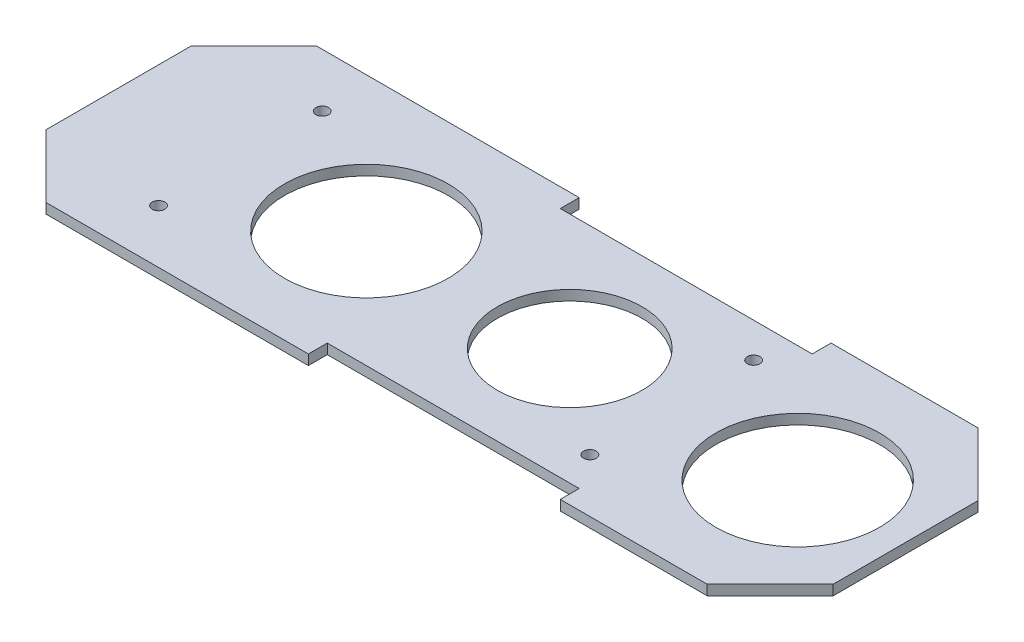
ISO-10303-21;
HEADER;
FILE_DESCRIPTION(('STEP AP214'),'2;1');
FILE_NAME('part.step','',(''),(''),'','','');
FILE_SCHEMA(('AUTOMOTIVE_DESIGN { 1 0 10303 214 1 1 1 1 }'));
ENDSEC;
DATA;
#1=APPLICATION_CONTEXT('core data for automotive mechanical design processes');
#2=APPLICATION_PROTOCOL_DEFINITION('international standard','automotive_design',2000,#1);
#3=PRODUCT_CONTEXT('',#1,'mechanical');
#4=PRODUCT('Part','Part','',(#3));
#5=PRODUCT_RELATED_PRODUCT_CATEGORY('part','',(#4));
#6=PRODUCT_DEFINITION_FORMATION('','',#4);
#7=PRODUCT_DEFINITION_CONTEXT('part definition',#1,'design');
#8=PRODUCT_DEFINITION('design','',#6,#7);
#9=PRODUCT_DEFINITION_SHAPE('','',#8);
#10=(LENGTH_UNIT() NAMED_UNIT(*) SI_UNIT(.MILLI.,.METRE.));
#11=(NAMED_UNIT(*) PLANE_ANGLE_UNIT() SI_UNIT($,.RADIAN.));
#12=(NAMED_UNIT(*) SI_UNIT($,.STERADIAN.) SOLID_ANGLE_UNIT());
#13=UNCERTAINTY_MEASURE_WITH_UNIT(LENGTH_MEASURE(1.E-05),#10,'distance_accuracy_value','');
#14=(GEOMETRIC_REPRESENTATION_CONTEXT(3) GLOBAL_UNCERTAINTY_ASSIGNED_CONTEXT((#13)) GLOBAL_UNIT_ASSIGNED_CONTEXT((#10,
#11,#12)) REPRESENTATION_CONTEXT('',''));
#15=CARTESIAN_POINT('',(0.,0.,0.));
#16=DIRECTION('',(0.,0.,1.));
#17=DIRECTION('',(1.,0.,0.));
#18=AXIS2_PLACEMENT_3D('',#15,#16,#17);
#19=CARTESIAN_POINT('',(91.6666666666666,1.6,0.));
#20=DIRECTION('',(-1.,0.,0.));
#21=DIRECTION('',(0.,0.,1.));
#22=AXIS2_PLACEMENT_3D('',#19,#20,#21);
#23=PLANE('',#22);
#24=DIRECTION('',(0.,0.,-1.));
#25=VECTOR('',#24,1.);
#26=CARTESIAN_POINT('',(91.6666666666666,0.,0.));
#27=LINE('',#26,#25);
#28=CARTESIAN_POINT('',(91.6666666666666,0.,21.5));
#29=VERTEX_POINT('',#28);
#30=CARTESIAN_POINT('',(91.6666666666666,0.,18.5));
#31=VERTEX_POINT('',#30);
#32=EDGE_CURVE('E159',#29,#31,#27,.T.);
#33=ORIENTED_EDGE('',*,*,#32,.F.);
#34=DIRECTION('',(0.,-1.,0.));
#35=VECTOR('',#34,1.);
#36=CARTESIAN_POINT('',(91.6666666666666,1.6,21.5));
#37=LINE('',#36,#35);
#38=CARTESIAN_POINT('',(91.6666666666666,1.6,21.5));
#39=VERTEX_POINT('',#38);
#40=EDGE_CURVE('E154',#39,#29,#37,.T.);
#41=ORIENTED_EDGE('',*,*,#40,.F.);
#42=DIRECTION('',(0.,0.,-1.));
#43=VECTOR('',#42,1.);
#44=CARTESIAN_POINT('',(91.6666666666666,1.6,0.));
#45=LINE('',#44,#43);
#46=CARTESIAN_POINT('',(91.6666666666666,1.6,18.5));
#47=VERTEX_POINT('',#46);
#48=EDGE_CURVE('E157',#39,#47,#45,.T.);
#49=ORIENTED_EDGE('',*,*,#48,.T.);
#50=DIRECTION('',(0.,-1.,0.));
#51=VECTOR('',#50,1.);
#52=CARTESIAN_POINT('',(91.6666666666666,1.6,18.5));
#53=LINE('',#52,#51);
#54=EDGE_CURVE('E212',#47,#31,#53,.T.);
#55=ORIENTED_EDGE('',*,*,#54,.T.);
#56=EDGE_LOOP('',(#33,#41,#49,#55));
#57=FACE_BOUND('',#56,.T.);
#58=ADVANCED_FACE('F40',(#57),#23,.T.);
#59=CARTESIAN_POINT('',(0.,1.6,21.5000000000002));
#60=DIRECTION('',(0.,0.,-1.));
#61=DIRECTION('',(-1.,0.,0.));
#62=AXIS2_PLACEMENT_3D('',#59,#60,#61);
#63=PLANE('',#62);
#64=DIRECTION('',(1.,0.,0.));
#65=VECTOR('',#64,1.);
#66=CARTESIAN_POINT('',(0.,0.,21.5000000000002));
#67=LINE('',#66,#65);
#68=CARTESIAN_POINT('',(115.,0.,21.4999999999999));
#69=VERTEX_POINT('',#68);
#70=EDGE_CURVE('E232',#29,#69,#67,.T.);
#71=ORIENTED_EDGE('',*,*,#70,.T.);
#72=DIRECTION('',(0.,1.,0.));
#73=VECTOR('',#72,1.);
#74=CARTESIAN_POINT('',(115.,1.6,21.4999999999999));
#75=LINE('',#74,#73);
#76=CARTESIAN_POINT('',(115.,1.6,21.4999999999999));
#77=VERTEX_POINT('',#76);
#78=EDGE_CURVE('E170',#69,#77,#75,.T.);
#79=ORIENTED_EDGE('',*,*,#78,.T.);
#80=DIRECTION('',(1.,0.,0.));
#81=VECTOR('',#80,1.);
#82=CARTESIAN_POINT('',(0.,1.6,21.5000000000002));
#83=LINE('',#82,#81);
#84=EDGE_CURVE('E167',#39,#77,#83,.T.);
#85=ORIENTED_EDGE('',*,*,#84,.F.);
#86=ORIENTED_EDGE('',*,*,#40,.T.);
#87=EDGE_LOOP('',(#71,#79,#85,#86));
#88=FACE_BOUND('',#87,.T.);
#89=ADVANCED_FACE('F168',(#88),#63,.F.);
#90=CARTESIAN_POINT('',(125.,1.6,0.));
#91=DIRECTION('',(1.,0.,0.));
#92=DIRECTION('',(0.,0.,-1.));
#93=AXIS2_PLACEMENT_3D('',#90,#91,#92);
#94=PLANE('',#93);
#95=DIRECTION('',(0.,0.,1.));
#96=VECTOR('',#95,1.);
#97=CARTESIAN_POINT('',(125.,0.,0.));
#98=LINE('',#97,#96);
#99=CARTESIAN_POINT('',(125.,0.,-11.4999999999999));
#100=VERTEX_POINT('',#99);
#101=CARTESIAN_POINT('',(125.,0.,11.4999999999999));
#102=VERTEX_POINT('',#101);
#103=EDGE_CURVE('E234',#100,#102,#98,.T.);
#104=ORIENTED_EDGE('',*,*,#103,.F.);
#105=DIRECTION('',(0.,1.,0.));
#106=VECTOR('',#105,1.);
#107=CARTESIAN_POINT('',(125.,1.6,-11.4999999999999));
#108=LINE('',#107,#106);
#109=CARTESIAN_POINT('',(125.,1.6,-11.4999999999999));
#110=VERTEX_POINT('',#109);
#111=EDGE_CURVE('E293',#100,#110,#108,.T.);
#112=ORIENTED_EDGE('',*,*,#111,.T.);
#113=DIRECTION('',(0.,0.,1.));
#114=VECTOR('',#113,1.);
#115=CARTESIAN_POINT('',(125.,1.6,0.));
#116=LINE('',#115,#114);
#117=CARTESIAN_POINT('',(125.,1.6,11.4999999999999));
#118=VERTEX_POINT('',#117);
#119=EDGE_CURVE('E172',#110,#118,#116,.T.);
#120=ORIENTED_EDGE('',*,*,#119,.T.);
#121=DIRECTION('',(0.,-1.,0.));
#122=VECTOR('',#121,1.);
#123=CARTESIAN_POINT('',(125.,0.,11.4999999999999));
#124=LINE('',#123,#122);
#125=EDGE_CURVE('E290',#118,#102,#124,.T.);
#126=ORIENTED_EDGE('',*,*,#125,.T.);
#127=EDGE_LOOP('',(#104,#112,#120,#126));
#128=FACE_BOUND('',#127,.T.);
#129=ADVANCED_FACE('F337',(#128),#94,.T.);
#130=CARTESIAN_POINT('',(0.,1.6,-21.5));
#131=DIRECTION('',(0.,0.,-1.));
#132=DIRECTION('',(-1.,0.,0.));
#133=AXIS2_PLACEMENT_3D('',#130,#131,#132);
#134=PLANE('',#133);
#135=DIRECTION('',(1.,0.,0.));
#136=VECTOR('',#135,1.);
#137=CARTESIAN_POINT('',(0.,1.6,-21.5));
#138=LINE('',#137,#136);
#139=CARTESIAN_POINT('',(91.6666666666666,1.6,-21.5));
#140=VERTEX_POINT('',#139);
#141=CARTESIAN_POINT('',(115.,1.6,-21.5));
#142=VERTEX_POINT('',#141);
#143=EDGE_CURVE('E189',#140,#142,#138,.T.);
#144=ORIENTED_EDGE('',*,*,#143,.T.);
#145=DIRECTION('',(0.,-1.,0.));
#146=VECTOR('',#145,1.);
#147=CARTESIAN_POINT('',(115.,1.6,-21.5));
#148=LINE('',#147,#146);
#149=CARTESIAN_POINT('',(115.,0.,-21.5));
#150=VERTEX_POINT('',#149);
#151=EDGE_CURVE('E163',#142,#150,#148,.T.);
#152=ORIENTED_EDGE('',*,*,#151,.T.);
#153=DIRECTION('',(1.,0.,0.));
#154=VECTOR('',#153,1.);
#155=CARTESIAN_POINT('',(0.,0.,-21.5));
#156=LINE('',#155,#154);
#157=CARTESIAN_POINT('',(91.6666666666666,0.,-21.5));
#158=VERTEX_POINT('',#157);
#159=EDGE_CURVE('E237',#158,#150,#156,.T.);
#160=ORIENTED_EDGE('',*,*,#159,.F.);
#161=DIRECTION('',(0.,-1.,0.));
#162=VECTOR('',#161,1.);
#163=CARTESIAN_POINT('',(91.6666666666666,1.6,-21.5));
#164=LINE('',#163,#162);
#165=EDGE_CURVE('E164',#140,#158,#164,.T.);
#166=ORIENTED_EDGE('',*,*,#165,.F.);
#167=EDGE_LOOP('',(#144,#152,#160,#166));
#168=FACE_BOUND('',#167,.T.);
#169=ADVANCED_FACE('F344',(#168),#134,.T.);
#170=CARTESIAN_POINT('',(91.6666666666666,1.6,0.));
#171=DIRECTION('',(1.,0.,0.));
#172=DIRECTION('',(0.,0.,-1.));
#173=AXIS2_PLACEMENT_3D('',#170,#171,#172);
#174=PLANE('',#173);
#175=DIRECTION('',(0.,0.,1.));
#176=VECTOR('',#175,1.);
#177=CARTESIAN_POINT('',(91.6666666666666,0.,0.));
#178=LINE('',#177,#176);
#179=CARTESIAN_POINT('',(91.6666666666666,0.,-18.5));
#180=VERTEX_POINT('',#179);
#181=EDGE_CURVE('E240',#158,#180,#178,.T.);
#182=ORIENTED_EDGE('',*,*,#181,.T.);
#183=DIRECTION('',(0.,-1.,0.));
#184=VECTOR('',#183,1.);
#185=CARTESIAN_POINT('',(91.6666666666666,1.6,-18.5));
#186=LINE('',#185,#184);
#187=CARTESIAN_POINT('',(91.6666666666666,1.6,-18.5));
#188=VERTEX_POINT('',#187);
#189=EDGE_CURVE('E277',#188,#180,#186,.T.);
#190=ORIENTED_EDGE('',*,*,#189,.F.);
#191=DIRECTION('',(0.,0.,1.));
#192=VECTOR('',#191,1.);
#193=CARTESIAN_POINT('',(91.6666666666666,1.6,0.));
#194=LINE('',#193,#192);
#195=EDGE_CURVE('E192',#140,#188,#194,.T.);
#196=ORIENTED_EDGE('',*,*,#195,.F.);
#197=ORIENTED_EDGE('',*,*,#165,.T.);
#198=EDGE_LOOP('',(#182,#190,#196,#197));
#199=FACE_BOUND('',#198,.T.);
#200=ADVANCED_FACE('F350',(#199),#174,.F.);
#201=CARTESIAN_POINT('',(0.,1.6,-18.5));
#202=DIRECTION('',(0.,0.,-1.));
#203=DIRECTION('',(-1.,0.,0.));
#204=AXIS2_PLACEMENT_3D('',#201,#202,#203);
#205=PLANE('',#204);
#206=DIRECTION('',(1.,0.,0.));
#207=VECTOR('',#206,1.);
#208=CARTESIAN_POINT('',(0.,0.,-18.5));
#209=LINE('',#208,#207);
#210=CARTESIAN_POINT('',(51.6666666666666,0.,-18.5));
#211=VERTEX_POINT('',#210);
#212=EDGE_CURVE('E243',#211,#180,#209,.T.);
#213=ORIENTED_EDGE('',*,*,#212,.F.);
#214=DIRECTION('',(0.,-1.,0.));
#215=VECTOR('',#214,1.);
#216=CARTESIAN_POINT('',(51.6666666666666,1.6,-18.5));
#217=LINE('',#216,#215);
#218=CARTESIAN_POINT('',(51.6666666666666,1.6,-18.5));
#219=VERTEX_POINT('',#218);
#220=EDGE_CURVE('E275',#219,#211,#217,.T.);
#221=ORIENTED_EDGE('',*,*,#220,.F.);
#222=DIRECTION('',(1.,0.,0.));
#223=VECTOR('',#222,1.);
#224=CARTESIAN_POINT('',(0.,1.6,-18.5));
#225=LINE('',#224,#223);
#226=EDGE_CURVE('E194',#219,#188,#225,.T.);
#227=ORIENTED_EDGE('',*,*,#226,.T.);
#228=ORIENTED_EDGE('',*,*,#189,.T.);
#229=EDGE_LOOP('',(#213,#221,#227,#228));
#230=FACE_BOUND('',#229,.T.);
#231=ADVANCED_FACE('F572',(#230),#205,.T.);
#232=CARTESIAN_POINT('',(51.6666666666666,1.6,0.));
#233=DIRECTION('',(1.,0.,0.));
#234=DIRECTION('',(0.,0.,-1.));
#235=AXIS2_PLACEMENT_3D('',#232,#233,#234);
#236=PLANE('',#235);
#237=DIRECTION('',(0.,0.,1.));
#238=VECTOR('',#237,1.);
#239=CARTESIAN_POINT('',(51.6666666666666,0.,0.));
#240=LINE('',#239,#238);
#241=CARTESIAN_POINT('',(51.6666666666666,0.,-21.5));
#242=VERTEX_POINT('',#241);
#243=EDGE_CURVE('E246',#242,#211,#240,.T.);
#244=ORIENTED_EDGE('',*,*,#243,.F.);
#245=DIRECTION('',(0.,-1.,0.));
#246=VECTOR('',#245,1.);
#247=CARTESIAN_POINT('',(51.6666666666666,1.6,-21.5));
#248=LINE('',#247,#246);
#249=CARTESIAN_POINT('',(51.6666666666666,1.6,-21.5));
#250=VERTEX_POINT('',#249);
#251=EDGE_CURVE('E272',#250,#242,#248,.T.);
#252=ORIENTED_EDGE('',*,*,#251,.F.);
#253=DIRECTION('',(0.,0.,1.));
#254=VECTOR('',#253,1.);
#255=CARTESIAN_POINT('',(51.6666666666666,1.6,0.));
#256=LINE('',#255,#254);
#257=EDGE_CURVE('E197',#250,#219,#256,.T.);
#258=ORIENTED_EDGE('',*,*,#257,.T.);
#259=ORIENTED_EDGE('',*,*,#220,.T.);
#260=EDGE_LOOP('',(#244,#252,#258,#259));
#261=FACE_BOUND('',#260,.T.);
#262=ADVANCED_FACE('F358',(#261),#236,.T.);
#263=CARTESIAN_POINT('',(0.,1.6,-21.5));
#264=DIRECTION('',(0.,0.,-1.));
#265=DIRECTION('',(-1.,0.,0.));
#266=AXIS2_PLACEMENT_3D('',#263,#264,#265);
#267=PLANE('',#266);
#268=DIRECTION('',(1.,0.,0.));
#269=VECTOR('',#268,1.);
#270=CARTESIAN_POINT('',(0.,0.,-21.5));
#271=LINE('',#270,#269);
#272=CARTESIAN_POINT('',(10.,0.,-21.5));
#273=VERTEX_POINT('',#272);
#274=EDGE_CURVE('E249',#273,#242,#271,.T.);
#275=ORIENTED_EDGE('',*,*,#274,.F.);
#276=DIRECTION('',(0.,1.,0.));
#277=VECTOR('',#276,1.);
#278=CARTESIAN_POINT('',(10.,1.6,-21.5));
#279=LINE('',#278,#277);
#280=CARTESIAN_POINT('',(10.,1.6,-21.5));
#281=VERTEX_POINT('',#280);
#282=EDGE_CURVE('E11',#273,#281,#279,.T.);
#283=ORIENTED_EDGE('',*,*,#282,.T.);
#284=DIRECTION('',(1.,0.,0.));
#285=VECTOR('',#284,1.);
#286=CARTESIAN_POINT('',(0.,1.6,-21.5));
#287=LINE('',#286,#285);
#288=EDGE_CURVE('E200',#281,#250,#287,.T.);
#289=ORIENTED_EDGE('',*,*,#288,.T.);
#290=ORIENTED_EDGE('',*,*,#251,.T.);
#291=EDGE_LOOP('',(#275,#283,#289,#290));
#292=FACE_BOUND('',#291,.T.);
#293=ADVANCED_FACE('F361',(#292),#267,.T.);
#294=CARTESIAN_POINT('',(0.,1.6,0.));
#295=DIRECTION('',(1.,0.,0.));
#296=DIRECTION('',(0.,0.,-1.));
#297=AXIS2_PLACEMENT_3D('',#294,#295,#296);
#298=PLANE('',#297);
#299=DIRECTION('',(0.,0.,1.));
#300=VECTOR('',#299,1.);
#301=CARTESIAN_POINT('',(0.,0.,0.));
#302=LINE('',#301,#300);
#303=CARTESIAN_POINT('',(0.,0.,-11.5));
#304=VERTEX_POINT('',#303);
#305=CARTESIAN_POINT('',(0.,0.,11.5));
#306=VERTEX_POINT('',#305);
#307=EDGE_CURVE('E251',#304,#306,#302,.T.);
#308=ORIENTED_EDGE('',*,*,#307,.T.);
#309=DIRECTION('',(0.,1.,0.));
#310=VECTOR('',#309,1.);
#311=CARTESIAN_POINT('',(0.,1.6,11.5));
#312=LINE('',#311,#310);
#313=CARTESIAN_POINT('',(0.,1.6,11.5));
#314=VERTEX_POINT('',#313);
#315=EDGE_CURVE('E49',#306,#314,#312,.T.);
#316=ORIENTED_EDGE('',*,*,#315,.T.);
#317=DIRECTION('',(0.,0.,1.));
#318=VECTOR('',#317,1.);
#319=CARTESIAN_POINT('',(0.,1.6,0.));
#320=LINE('',#319,#318);
#321=CARTESIAN_POINT('',(0.,1.6,-11.5));
#322=VERTEX_POINT('',#321);
#323=EDGE_CURVE('E202',#322,#314,#320,.T.);
#324=ORIENTED_EDGE('',*,*,#323,.F.);
#325=DIRECTION('',(0.,-1.,0.));
#326=VECTOR('',#325,1.);
#327=CARTESIAN_POINT('',(0.,0.,-11.5));
#328=LINE('',#327,#326);
#329=EDGE_CURVE('E306',#322,#304,#328,.T.);
#330=ORIENTED_EDGE('',*,*,#329,.T.);
#331=EDGE_LOOP('',(#308,#316,#324,#330));
#332=FACE_BOUND('',#331,.T.);
#333=ADVANCED_FACE('F310',(#332),#298,.F.);
#334=CARTESIAN_POINT('',(0.,1.6,21.5));
#335=DIRECTION('',(0.,0.,-1.));
#336=DIRECTION('',(-1.,0.,0.));
#337=AXIS2_PLACEMENT_3D('',#334,#335,#336);
#338=PLANE('',#337);
#339=DIRECTION('',(1.,0.,0.));
#340=VECTOR('',#339,1.);
#341=CARTESIAN_POINT('',(0.,1.6,21.5));
#342=LINE('',#341,#340);
#343=CARTESIAN_POINT('',(10.,1.6,21.5));
#344=VERTEX_POINT('',#343);
#345=CARTESIAN_POINT('',(51.6666666666666,1.6,21.5));
#346=VERTEX_POINT('',#345);
#347=EDGE_CURVE('E204',#344,#346,#342,.T.);
#348=ORIENTED_EDGE('',*,*,#347,.F.);
#349=DIRECTION('',(0.,-1.,0.));
#350=VECTOR('',#349,1.);
#351=CARTESIAN_POINT('',(10.,1.6,21.5));
#352=LINE('',#351,#350);
#353=CARTESIAN_POINT('',(10.,0.,21.5));
#354=VERTEX_POINT('',#353);
#355=EDGE_CURVE('E303',#344,#354,#352,.T.);
#356=ORIENTED_EDGE('',*,*,#355,.T.);
#357=DIRECTION('',(1.,0.,0.));
#358=VECTOR('',#357,1.);
#359=CARTESIAN_POINT('',(0.,0.,21.5));
#360=LINE('',#359,#358);
#361=CARTESIAN_POINT('',(51.6666666666666,0.,21.5));
#362=VERTEX_POINT('',#361);
#363=EDGE_CURVE('E253',#354,#362,#360,.T.);
#364=ORIENTED_EDGE('',*,*,#363,.T.);
#365=DIRECTION('',(0.,-1.,0.));
#366=VECTOR('',#365,1.);
#367=CARTESIAN_POINT('',(51.6666666666666,1.6,21.5));
#368=LINE('',#367,#366);
#369=EDGE_CURVE('E269',#346,#362,#368,.T.);
#370=ORIENTED_EDGE('',*,*,#369,.F.);
#371=EDGE_LOOP('',(#348,#356,#364,#370));
#372=FACE_BOUND('',#371,.T.);
#373=ADVANCED_FACE('F323',(#372),#338,.F.);
#374=CARTESIAN_POINT('',(51.6666666666666,1.6,0.));
#375=DIRECTION('',(-1.,0.,0.));
#376=DIRECTION('',(0.,0.,1.));
#377=AXIS2_PLACEMENT_3D('',#374,#375,#376);
#378=PLANE('',#377);
#379=DIRECTION('',(0.,0.,-1.));
#380=VECTOR('',#379,1.);
#381=CARTESIAN_POINT('',(51.6666666666666,0.,0.));
#382=LINE('',#381,#380);
#383=CARTESIAN_POINT('',(51.6666666666666,0.,18.5));
#384=VERTEX_POINT('',#383);
#385=EDGE_CURVE('E255',#362,#384,#382,.T.);
#386=ORIENTED_EDGE('',*,*,#385,.T.);
#387=DIRECTION('',(0.,-1.,0.));
#388=VECTOR('',#387,1.);
#389=CARTESIAN_POINT('',(51.6666666666666,1.6,18.5));
#390=LINE('',#389,#388);
#391=CARTESIAN_POINT('',(51.6666666666666,1.6,18.5));
#392=VERTEX_POINT('',#391);
#393=EDGE_CURVE('E266',#392,#384,#390,.T.);
#394=ORIENTED_EDGE('',*,*,#393,.F.);
#395=DIRECTION('',(0.,0.,-1.));
#396=VECTOR('',#395,1.);
#397=CARTESIAN_POINT('',(51.6666666666666,1.6,0.));
#398=LINE('',#397,#396);
#399=EDGE_CURVE('E206',#346,#392,#398,.T.);
#400=ORIENTED_EDGE('',*,*,#399,.F.);
#401=ORIENTED_EDGE('',*,*,#369,.T.);
#402=EDGE_LOOP('',(#386,#394,#400,#401));
#403=FACE_BOUND('',#402,.T.);
#404=ADVANCED_FACE('F328',(#403),#378,.F.);
#405=CARTESIAN_POINT('',(0.,1.6,18.5));
#406=DIRECTION('',(0.,0.,-1.));
#407=DIRECTION('',(-1.,0.,0.));
#408=AXIS2_PLACEMENT_3D('',#405,#406,#407);
#409=PLANE('',#408);
#410=DIRECTION('',(1.,0.,0.));
#411=VECTOR('',#410,1.);
#412=CARTESIAN_POINT('',(0.,0.,18.5));
#413=LINE('',#412,#411);
#414=EDGE_CURVE('E258',#384,#31,#413,.T.);
#415=ORIENTED_EDGE('',*,*,#414,.T.);
#416=ORIENTED_EDGE('',*,*,#54,.F.);
#417=DIRECTION('',(1.,0.,0.));
#418=VECTOR('',#417,1.);
#419=CARTESIAN_POINT('',(0.,1.6,18.5));
#420=LINE('',#419,#418);
#421=EDGE_CURVE('E178',#392,#47,#420,.T.);
#422=ORIENTED_EDGE('',*,*,#421,.F.);
#423=ORIENTED_EDGE('',*,*,#393,.T.);
#424=EDGE_LOOP('',(#415,#416,#422,#423));
#425=FACE_BOUND('',#424,.T.);
#426=ADVANCED_FACE('F330',(#425),#409,.F.);
#427=CARTESIAN_POINT('',(19.37,1.6,-13.));
#428=DIRECTION('',(0.,-1.,0.));
#429=DIRECTION('',(0.,0.,-1.));
#430=AXIS2_PLACEMENT_3D('',#427,#428,#429);
#431=CYLINDRICAL_SURFACE('',#430,1.);
#432=CARTESIAN_POINT('',(19.37,1.6,-13.));
#433=DIRECTION('',(0.,1.,0.));
#434=DIRECTION('',(0.,0.,1.));
#435=AXIS2_PLACEMENT_3D('',#432,#433,#434);
#436=CIRCLE('',#435,1.);
#437=CARTESIAN_POINT('',(19.37,1.6,-12.));
#438=VERTEX_POINT('',#437);
#439=EDGE_CURVE('E180',#438,#438,#436,.T.);
#440=ORIENTED_EDGE('',*,*,#439,.T.);
#441=EDGE_LOOP('',(#440));
#442=FACE_BOUND('',#441,.T.);
#443=CARTESIAN_POINT('',(19.37,0.,-13.));
#444=DIRECTION('',(0.,1.,0.));
#445=DIRECTION('',(0.,0.,1.));
#446=AXIS2_PLACEMENT_3D('',#443,#444,#445);
#447=CIRCLE('',#446,1.);
#448=CARTESIAN_POINT('',(19.37,0.,-12.));
#449=VERTEX_POINT('',#448);
#450=EDGE_CURVE('E228',#449,#449,#447,.T.);
#451=ORIENTED_EDGE('',*,*,#450,.F.);
#452=EDGE_LOOP('',(#451));
#453=FACE_BOUND('',#452,.T.);
#454=ADVANCED_FACE('F375',(#442,#453),#431,.F.);
#455=CARTESIAN_POINT('',(87.87,1.6,-13.));
#456=DIRECTION('',(0.,-1.,0.));
#457=DIRECTION('',(0.,0.,-1.));
#458=AXIS2_PLACEMENT_3D('',#455,#456,#457);
#459=CYLINDRICAL_SURFACE('',#458,0.999999999999998);
#460=CARTESIAN_POINT('',(87.87,1.6,-13.));
#461=DIRECTION('',(0.,1.,0.));
#462=DIRECTION('',(0.,0.,1.));
#463=AXIS2_PLACEMENT_3D('',#460,#461,#462);
#464=CIRCLE('',#463,0.999999999999998);
#465=CARTESIAN_POINT('',(87.87,1.6,-12.));
#466=VERTEX_POINT('',#465);
#467=EDGE_CURVE('E183',#466,#466,#464,.T.);
#468=ORIENTED_EDGE('',*,*,#467,.T.);
#469=EDGE_LOOP('',(#468));
#470=FACE_BOUND('',#469,.T.);
#471=CARTESIAN_POINT('',(87.87,0.,-13.));
#472=DIRECTION('',(0.,1.,0.));
#473=DIRECTION('',(0.,0.,1.));
#474=AXIS2_PLACEMENT_3D('',#471,#472,#473);
#475=CIRCLE('',#474,0.999999999999998);
#476=CARTESIAN_POINT('',(87.87,0.,-12.));
#477=VERTEX_POINT('',#476);
#478=EDGE_CURVE('E225',#477,#477,#475,.T.);
#479=ORIENTED_EDGE('',*,*,#478,.F.);
#480=EDGE_LOOP('',(#479));
#481=FACE_BOUND('',#480,.T.);
#482=ADVANCED_FACE('F378',(#470,#481),#459,.F.);
#483=CARTESIAN_POINT('',(87.87,1.6,13.));
#484=DIRECTION('',(0.,-1.,0.));
#485=DIRECTION('',(0.,0.,-1.));
#486=AXIS2_PLACEMENT_3D('',#483,#484,#485);
#487=CYLINDRICAL_SURFACE('',#486,0.999999999999998);
#488=CARTESIAN_POINT('',(87.87,1.6,13.));
#489=DIRECTION('',(0.,1.,0.));
#490=DIRECTION('',(0.,0.,1.));
#491=AXIS2_PLACEMENT_3D('',#488,#489,#490);
#492=CIRCLE('',#491,0.999999999999998);
#493=CARTESIAN_POINT('',(87.87,1.6,14.));
#494=VERTEX_POINT('',#493);
#495=EDGE_CURVE('E612',#494,#494,#492,.F.);
#496=ORIENTED_EDGE('',*,*,#495,.F.);
#497=EDGE_LOOP('',(#496));
#498=FACE_BOUND('',#497,.T.);
#499=CARTESIAN_POINT('',(87.87,0.,13.));
#500=DIRECTION('',(0.,1.,0.));
#501=DIRECTION('',(0.,0.,1.));
#502=AXIS2_PLACEMENT_3D('',#499,#500,#501);
#503=CIRCLE('',#502,0.999999999999998);
#504=CARTESIAN_POINT('',(87.87,0.,14.));
#505=VERTEX_POINT('',#504);
#506=EDGE_CURVE('E222',#505,#505,#503,.F.);
#507=ORIENTED_EDGE('',*,*,#506,.T.);
#508=EDGE_LOOP('',(#507));
#509=FACE_BOUND('',#508,.T.);
#510=ADVANCED_FACE('F382',(#498,#509),#487,.F.);
#511=CARTESIAN_POINT('',(39.37,1.6,0.));
#512=DIRECTION('',(0.,-1.,0.));
#513=DIRECTION('',(0.,0.,-1.));
#514=AXIS2_PLACEMENT_3D('',#511,#512,#513);
#515=CYLINDRICAL_SURFACE('',#514,13.);
#516=CARTESIAN_POINT('',(39.37,1.6,0.));
#517=DIRECTION('',(0.,1.,0.));
#518=DIRECTION('',(0.,0.,1.));
#519=AXIS2_PLACEMENT_3D('',#516,#517,#518);
#520=CIRCLE('',#519,13.);
#521=CARTESIAN_POINT('',(39.37,1.6,13.));
#522=VERTEX_POINT('',#521);
#523=EDGE_CURVE('E608',#522,#522,#520,.T.);
#524=ORIENTED_EDGE('',*,*,#523,.T.);
#525=EDGE_LOOP('',(#524));
#526=FACE_BOUND('',#525,.T.);
#527=CARTESIAN_POINT('',(39.37,0.,0.));
#528=DIRECTION('',(0.,1.,0.));
#529=DIRECTION('',(0.,0.,1.));
#530=AXIS2_PLACEMENT_3D('',#527,#528,#529);
#531=CIRCLE('',#530,13.);
#532=CARTESIAN_POINT('',(39.37,0.,13.));
#533=VERTEX_POINT('',#532);
#534=EDGE_CURVE('E219',#533,#533,#531,.T.);
#535=ORIENTED_EDGE('',*,*,#534,.F.);
#536=EDGE_LOOP('',(#535));
#537=FACE_BOUND('',#536,.T.);
#538=ADVANCED_FACE('F386',(#526,#537),#515,.F.);
#539=CARTESIAN_POINT('',(107.87,1.6,0.));
#540=DIRECTION('',(0.,-1.,0.));
#541=DIRECTION('',(0.,0.,-1.));
#542=AXIS2_PLACEMENT_3D('',#539,#540,#541);
#543=CYLINDRICAL_SURFACE('',#542,13.);
#544=CARTESIAN_POINT('',(107.87,1.6,0.));
#545=DIRECTION('',(0.,1.,0.));
#546=DIRECTION('',(0.,0.,1.));
#547=AXIS2_PLACEMENT_3D('',#544,#545,#546);
#548=CIRCLE('',#547,13.);
#549=CARTESIAN_POINT('',(107.87,1.6,13.));
#550=VERTEX_POINT('',#549);
#551=EDGE_CURVE('E604',#550,#550,#548,.T.);
#552=ORIENTED_EDGE('',*,*,#551,.T.);
#553=EDGE_LOOP('',(#552));
#554=FACE_BOUND('',#553,.T.);
#555=CARTESIAN_POINT('',(107.87,0.,0.));
#556=DIRECTION('',(0.,1.,0.));
#557=DIRECTION('',(0.,0.,1.));
#558=AXIS2_PLACEMENT_3D('',#555,#556,#557);
#559=CIRCLE('',#558,13.);
#560=CARTESIAN_POINT('',(107.87,0.,13.));
#561=VERTEX_POINT('',#560);
#562=EDGE_CURVE('E216',#561,#561,#559,.T.);
#563=ORIENTED_EDGE('',*,*,#562,.F.);
#564=EDGE_LOOP('',(#563));
#565=FACE_BOUND('',#564,.T.);
#566=ADVANCED_FACE('F390',(#554,#565),#543,.F.);
#567=CARTESIAN_POINT('',(71.6666666666666,1.6,0.));
#568=DIRECTION('',(0.,-1.,0.));
#569=DIRECTION('',(0.,0.,-1.));
#570=AXIS2_PLACEMENT_3D('',#567,#568,#569);
#571=CYLINDRICAL_SURFACE('',#570,11.5);
#572=CARTESIAN_POINT('',(71.6666666666666,1.6,0.));
#573=DIRECTION('',(0.,1.,0.));
#574=DIRECTION('',(0.,0.,1.));
#575=AXIS2_PLACEMENT_3D('',#572,#573,#574);
#576=CIRCLE('',#575,11.5);
#577=CARTESIAN_POINT('',(71.6666666666666,1.6,11.5));
#578=VERTEX_POINT('',#577);
#579=EDGE_CURVE('E264',#578,#578,#576,.T.);
#580=ORIENTED_EDGE('',*,*,#579,.T.);
#581=EDGE_LOOP('',(#580));
#582=FACE_BOUND('',#581,.T.);
#583=CARTESIAN_POINT('',(71.6666666666666,0.,0.));
#584=DIRECTION('',(0.,1.,0.));
#585=DIRECTION('',(0.,0.,1.));
#586=AXIS2_PLACEMENT_3D('',#583,#584,#585);
#587=CIRCLE('',#586,11.5);
#588=CARTESIAN_POINT('',(71.6666666666666,0.,11.5));
#589=VERTEX_POINT('',#588);
#590=EDGE_CURVE('E213',#589,#589,#587,.T.);
#591=ORIENTED_EDGE('',*,*,#590,.F.);
#592=EDGE_LOOP('',(#591));
#593=FACE_BOUND('',#592,.T.);
#594=ADVANCED_FACE('F394',(#582,#593),#571,.F.);
#595=CARTESIAN_POINT('',(19.37,1.6,13.));
#596=DIRECTION('',(0.,-1.,0.));
#597=DIRECTION('',(0.,0.,-1.));
#598=AXIS2_PLACEMENT_3D('',#595,#596,#597);
#599=CYLINDRICAL_SURFACE('',#598,1.);
#600=CARTESIAN_POINT('',(19.37,1.6,13.));
#601=DIRECTION('',(0.,1.,0.));
#602=DIRECTION('',(0.,0.,1.));
#603=AXIS2_PLACEMENT_3D('',#600,#601,#602);
#604=CIRCLE('',#603,1.);
#605=CARTESIAN_POINT('',(19.37,1.6,14.));
#606=VERTEX_POINT('',#605);
#607=EDGE_CURVE('E209',#606,#606,#604,.F.);
#608=ORIENTED_EDGE('',*,*,#607,.F.);
#609=EDGE_LOOP('',(#608));
#610=FACE_BOUND('',#609,.T.);
#611=CARTESIAN_POINT('',(19.37,0.,13.));
#612=DIRECTION('',(0.,1.,0.));
#613=DIRECTION('',(0.,0.,1.));
#614=AXIS2_PLACEMENT_3D('',#611,#612,#613);
#615=CIRCLE('',#614,1.);
#616=CARTESIAN_POINT('',(19.37,0.,14.));
#617=VERTEX_POINT('',#616);
#618=EDGE_CURVE('E261',#617,#617,#615,.F.);
#619=ORIENTED_EDGE('',*,*,#618,.T.);
#620=EDGE_LOOP('',(#619));
#621=FACE_BOUND('',#620,.T.);
#622=ADVANCED_FACE('F398',(#610,#621),#599,.F.);
#623=CARTESIAN_POINT('',(0.,1.6,0.));
#624=DIRECTION('',(0.,1.,0.));
#625=DIRECTION('',(0.,0.,1.));
#626=AXIS2_PLACEMENT_3D('',#623,#624,#625);
#627=PLANE('',#626);
#628=ORIENTED_EDGE('',*,*,#579,.F.);
#629=EDGE_LOOP('',(#628));
#630=FACE_BOUND('',#629,.T.);
#631=ORIENTED_EDGE('',*,*,#551,.F.);
#632=EDGE_LOOP('',(#631));
#633=FACE_BOUND('',#632,.T.);
#634=ORIENTED_EDGE('',*,*,#523,.F.);
#635=EDGE_LOOP('',(#634));
#636=FACE_BOUND('',#635,.T.);
#637=ORIENTED_EDGE('',*,*,#495,.T.);
#638=EDGE_LOOP('',(#637));
#639=FACE_BOUND('',#638,.T.);
#640=ORIENTED_EDGE('',*,*,#467,.F.);
#641=EDGE_LOOP('',(#640));
#642=FACE_BOUND('',#641,.T.);
#643=ORIENTED_EDGE('',*,*,#439,.F.);
#644=EDGE_LOOP('',(#643));
#645=FACE_BOUND('',#644,.T.);
#646=ORIENTED_EDGE('',*,*,#119,.F.);
#647=DIRECTION('',(0.707106781186546,0.,0.707106781186549));
#648=VECTOR('',#647,1.);
#649=CARTESIAN_POINT('',(68.2500000000002,1.6,-68.2499999999999));
#650=LINE('',#649,#648);
#651=EDGE_CURVE('E300',#110,#142,#650,.F.);
#652=ORIENTED_EDGE('',*,*,#651,.T.);
#653=ORIENTED_EDGE('',*,*,#143,.F.);
#654=ORIENTED_EDGE('',*,*,#195,.T.);
#655=ORIENTED_EDGE('',*,*,#226,.F.);
#656=ORIENTED_EDGE('',*,*,#257,.F.);
#657=ORIENTED_EDGE('',*,*,#288,.F.);
#658=DIRECTION('',(-0.707106781186549,0.,0.707106781186547));
#659=VECTOR('',#658,1.);
#660=CARTESIAN_POINT('',(-5.75,1.6,-5.75000000000001));
#661=LINE('',#660,#659);
#662=EDGE_CURVE('E295',#281,#322,#661,.T.);
#663=ORIENTED_EDGE('',*,*,#662,.T.);
#664=ORIENTED_EDGE('',*,*,#323,.T.);
#665=DIRECTION('',(-0.707106781186547,0.,-0.707106781186549));
#666=VECTOR('',#665,1.);
#667=CARTESIAN_POINT('',(-5.74999999999998,1.6,5.74999999999996));
#668=LINE('',#667,#666);
#669=EDGE_CURVE('E56',#314,#344,#668,.F.);
#670=ORIENTED_EDGE('',*,*,#669,.T.);
#671=ORIENTED_EDGE('',*,*,#347,.T.);
#672=ORIENTED_EDGE('',*,*,#399,.T.);
#673=ORIENTED_EDGE('',*,*,#421,.T.);
#674=ORIENTED_EDGE('',*,*,#48,.F.);
#675=ORIENTED_EDGE('',*,*,#84,.T.);
#676=DIRECTION('',(0.707106781186548,0.,-0.707106781186548));
#677=VECTOR('',#676,1.);
#678=CARTESIAN_POINT('',(68.2499999999999,1.6,68.2499999999999));
#679=LINE('',#678,#677);
#680=EDGE_CURVE('E298',#77,#118,#679,.T.);
#681=ORIENTED_EDGE('',*,*,#680,.T.);
#682=EDGE_LOOP('',(#646,#652,#653,#654,#655,#656,#657,#663,#664,#670,#671,#672,#673,#674,#675,#681));
#683=FACE_BOUND('',#682,.T.);
#684=ORIENTED_EDGE('',*,*,#607,.T.);
#685=EDGE_LOOP('',(#684));
#686=FACE_BOUND('',#685,.T.);
#687=ADVANCED_FACE('F175',(#630,#633,#636,#639,#642,#645,#683,#686),#627,.T.);
#688=CARTESIAN_POINT('',(0.,0.,0.));
#689=DIRECTION('',(0.,1.,0.));
#690=DIRECTION('',(0.,0.,1.));
#691=AXIS2_PLACEMENT_3D('',#688,#689,#690);
#692=PLANE('',#691);
#693=ORIENTED_EDGE('',*,*,#590,.T.);
#694=EDGE_LOOP('',(#693));
#695=FACE_BOUND('',#694,.T.);
#696=ORIENTED_EDGE('',*,*,#562,.T.);
#697=EDGE_LOOP('',(#696));
#698=FACE_BOUND('',#697,.T.);
#699=ORIENTED_EDGE('',*,*,#534,.T.);
#700=EDGE_LOOP('',(#699));
#701=FACE_BOUND('',#700,.T.);
#702=ORIENTED_EDGE('',*,*,#506,.F.);
#703=EDGE_LOOP('',(#702));
#704=FACE_BOUND('',#703,.T.);
#705=ORIENTED_EDGE('',*,*,#478,.T.);
#706=EDGE_LOOP('',(#705));
#707=FACE_BOUND('',#706,.T.);
#708=ORIENTED_EDGE('',*,*,#450,.T.);
#709=EDGE_LOOP('',(#708));
#710=FACE_BOUND('',#709,.T.);
#711=ORIENTED_EDGE('',*,*,#159,.T.);
#712=DIRECTION('',(-0.707106781186546,0.,-0.707106781186549));
#713=VECTOR('',#712,1.);
#714=CARTESIAN_POINT('',(115.,0.,-21.5));
#715=LINE('',#714,#713);
#716=EDGE_CURVE('E288',#150,#100,#715,.F.);
#717=ORIENTED_EDGE('',*,*,#716,.T.);
#718=ORIENTED_EDGE('',*,*,#103,.T.);
#719=DIRECTION('',(-0.707106781186548,0.,0.707106781186548));
#720=VECTOR('',#719,1.);
#721=CARTESIAN_POINT('',(125.,0.,11.4999999999999));
#722=LINE('',#721,#720);
#723=EDGE_CURVE('E286',#102,#69,#722,.T.);
#724=ORIENTED_EDGE('',*,*,#723,.T.);
#725=ORIENTED_EDGE('',*,*,#70,.F.);
#726=ORIENTED_EDGE('',*,*,#32,.T.);
#727=ORIENTED_EDGE('',*,*,#414,.F.);
#728=ORIENTED_EDGE('',*,*,#385,.F.);
#729=ORIENTED_EDGE('',*,*,#363,.F.);
#730=DIRECTION('',(0.707106781186547,0.,0.707106781186549));
#731=VECTOR('',#730,1.);
#732=CARTESIAN_POINT('',(10.,0.,21.5));
#733=LINE('',#732,#731);
#734=EDGE_CURVE('E284',#354,#306,#733,.F.);
#735=ORIENTED_EDGE('',*,*,#734,.T.);
#736=ORIENTED_EDGE('',*,*,#307,.F.);
#737=DIRECTION('',(0.707106781186549,0.,-0.707106781186547));
#738=VECTOR('',#737,1.);
#739=CARTESIAN_POINT('',(0.,0.,-11.5));
#740=LINE('',#739,#738);
#741=EDGE_CURVE('E282',#304,#273,#740,.T.);
#742=ORIENTED_EDGE('',*,*,#741,.T.);
#743=ORIENTED_EDGE('',*,*,#274,.T.);
#744=ORIENTED_EDGE('',*,*,#243,.T.);
#745=ORIENTED_EDGE('',*,*,#212,.T.);
#746=ORIENTED_EDGE('',*,*,#181,.F.);
#747=EDGE_LOOP('',(#711,#717,#718,#724,#725,#726,#727,#728,#729,#735,#736,#742,#743,#744,#745,#746));
#748=FACE_BOUND('',#747,.T.);
#749=ORIENTED_EDGE('',*,*,#618,.F.);
#750=EDGE_LOOP('',(#749));
#751=FACE_BOUND('',#750,.T.);
#752=ADVANCED_FACE('F314',(#695,#698,#701,#704,#707,#710,#748,#751),#692,.F.);
#753=CARTESIAN_POINT('',(115.,1.6,-21.5));
#754=DIRECTION('',(-0.707106781186549,0.,0.707106781186546));
#755=DIRECTION('',(0.,-1.,0.));
#756=AXIS2_PLACEMENT_3D('',#753,#754,#755);
#757=PLANE('',#756);
#758=ORIENTED_EDGE('',*,*,#651,.F.);
#759=ORIENTED_EDGE('',*,*,#111,.F.);
#760=ORIENTED_EDGE('',*,*,#716,.F.);
#761=ORIENTED_EDGE('',*,*,#151,.F.);
#762=EDGE_LOOP('',(#758,#759,#760,#761));
#763=FACE_BOUND('',#762,.T.);
#764=ADVANCED_FACE('F340',(#763),#757,.F.);
#765=CARTESIAN_POINT('',(125.,1.6,11.4999999999999));
#766=DIRECTION('',(0.707106781186548,0.,0.707106781186548));
#767=DIRECTION('',(0.,1.,0.));
#768=AXIS2_PLACEMENT_3D('',#765,#766,#767);
#769=PLANE('',#768);
#770=ORIENTED_EDGE('',*,*,#680,.F.);
#771=ORIENTED_EDGE('',*,*,#78,.F.);
#772=ORIENTED_EDGE('',*,*,#723,.F.);
#773=ORIENTED_EDGE('',*,*,#125,.F.);
#774=EDGE_LOOP('',(#770,#771,#772,#773));
#775=FACE_BOUND('',#774,.T.);
#776=ADVANCED_FACE('F332',(#775),#769,.T.);
#777=CARTESIAN_POINT('',(10.,1.6,21.5));
#778=DIRECTION('',(0.707106781186549,0.,-0.707106781186547));
#779=DIRECTION('',(0.,-1.,0.));
#780=AXIS2_PLACEMENT_3D('',#777,#778,#779);
#781=PLANE('',#780);
#782=ORIENTED_EDGE('',*,*,#669,.F.);
#783=ORIENTED_EDGE('',*,*,#315,.F.);
#784=ORIENTED_EDGE('',*,*,#734,.F.);
#785=ORIENTED_EDGE('',*,*,#355,.F.);
#786=EDGE_LOOP('',(#782,#783,#784,#785));
#787=FACE_BOUND('',#786,.T.);
#788=ADVANCED_FACE('F321',(#787),#781,.F.);
#789=CARTESIAN_POINT('',(0.,1.6,-11.5));
#790=DIRECTION('',(-0.707106781186547,0.,-0.707106781186549));
#791=DIRECTION('',(0.,1.,0.));
#792=AXIS2_PLACEMENT_3D('',#789,#790,#791);
#793=PLANE('',#792);
#794=ORIENTED_EDGE('',*,*,#662,.F.);
#795=ORIENTED_EDGE('',*,*,#282,.F.);
#796=ORIENTED_EDGE('',*,*,#741,.F.);
#797=ORIENTED_EDGE('',*,*,#329,.F.);
#798=EDGE_LOOP('',(#794,#795,#796,#797));
#799=FACE_BOUND('',#798,.T.);
#800=ADVANCED_FACE('F43',(#799),#793,.T.);
#801=CLOSED_SHELL('',(#58,#89,#129,#169,#200,#231,#262,#293,#333,#373,#404,#426,#454,#482,#510,
#538,#566,#594,#622,#687,#752,#764,#776,#788,#800));
#802=MANIFOLD_SOLID_BREP('B2',#801);
#803=ADVANCED_BREP_SHAPE_REPRESENTATION('',(#18,#802),#14);
#804=SHAPE_DEFINITION_REPRESENTATION(#9,#803);
ENDSEC;
END-ISO-10303-21;
